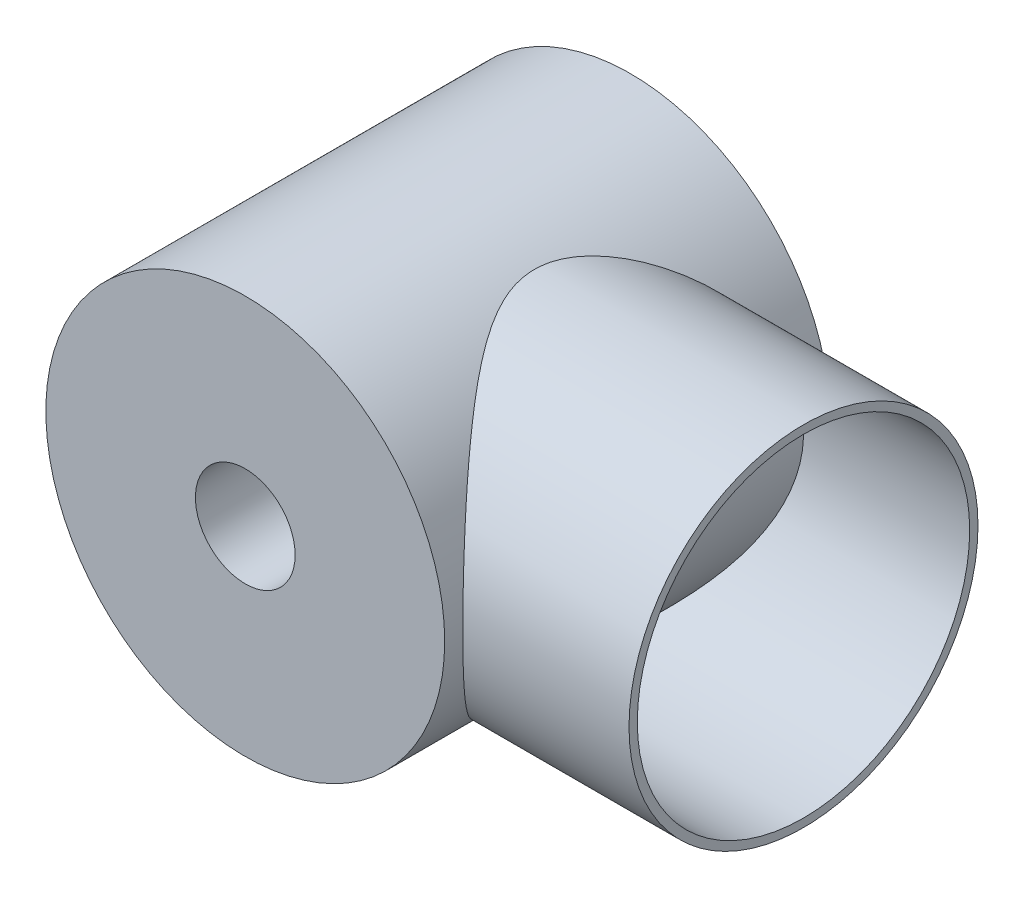
ISO-10303-21;
HEADER;
FILE_DESCRIPTION(('STEP AP214'),'2;1');
FILE_NAME('part.step','',(''),(''),'','','');
FILE_SCHEMA(('AUTOMOTIVE_DESIGN { 1 0 10303 214 1 1 1 1 }'));
ENDSEC;
DATA;
#1=APPLICATION_CONTEXT('core data for automotive mechanical design processes');
#2=APPLICATION_PROTOCOL_DEFINITION('international standard','automotive_design',2000,#1);
#3=PRODUCT_CONTEXT('',#1,'mechanical');
#4=PRODUCT('Part','Part','',(#3));
#5=PRODUCT_RELATED_PRODUCT_CATEGORY('part','',(#4));
#6=PRODUCT_DEFINITION_FORMATION('','',#4);
#7=PRODUCT_DEFINITION_CONTEXT('part definition',#1,'design');
#8=PRODUCT_DEFINITION('design','',#6,#7);
#9=PRODUCT_DEFINITION_SHAPE('','',#8);
#10=(LENGTH_UNIT() NAMED_UNIT(*) SI_UNIT(.MILLI.,.METRE.));
#11=(NAMED_UNIT(*) PLANE_ANGLE_UNIT() SI_UNIT($,.RADIAN.));
#12=(NAMED_UNIT(*) SI_UNIT($,.STERADIAN.) SOLID_ANGLE_UNIT());
#13=UNCERTAINTY_MEASURE_WITH_UNIT(LENGTH_MEASURE(1.E-05),#10,'distance_accuracy_value','');
#14=(GEOMETRIC_REPRESENTATION_CONTEXT(3) GLOBAL_UNCERTAINTY_ASSIGNED_CONTEXT((#13)) GLOBAL_UNIT_ASSIGNED_CONTEXT((#10,
#11,#12)) REPRESENTATION_CONTEXT('',''));
#15=CARTESIAN_POINT('',(0.,0.,0.));
#16=DIRECTION('',(0.,0.,1.));
#17=DIRECTION('',(1.,0.,0.));
#18=AXIS2_PLACEMENT_3D('',#15,#16,#17);
#19=CARTESIAN_POINT('',(0.,0.,11.59));
#20=DIRECTION('',(0.,0.,-1.));
#21=DIRECTION('',(-1.,0.,0.));
#22=AXIS2_PLACEMENT_3D('',#19,#20,#21);
#23=CYLINDRICAL_SURFACE('',#22,12.);
#24=CARTESIAN_POINT('',(0.,0.,-11.59));
#25=DIRECTION('',(0.,0.,1.));
#26=DIRECTION('',(1.,0.,0.));
#27=AXIS2_PLACEMENT_3D('',#24,#25,#26);
#28=CIRCLE('',#27,12.);
#29=CARTESIAN_POINT('',(12.,0.,-11.59));
#30=VERTEX_POINT('',#29);
#31=EDGE_CURVE('E56',#30,#30,#28,.T.);
#32=ORIENTED_EDGE('',*,*,#31,.T.);
#33=EDGE_LOOP('',(#32));
#34=FACE_BOUND('',#33,.T.);
#35=CARTESIAN_POINT('',(0.,0.,11.59));
#36=DIRECTION('',(0.,0.,1.));
#37=DIRECTION('',(1.,0.,0.));
#38=AXIS2_PLACEMENT_3D('',#35,#36,#37);
#39=CIRCLE('',#38,12.);
#40=CARTESIAN_POINT('',(12.,0.,11.59));
#41=VERTEX_POINT('',#40);
#42=EDGE_CURVE('E52',#41,#41,#39,.T.);
#43=ORIENTED_EDGE('',*,*,#42,.F.);
#44=EDGE_LOOP('',(#43));
#45=FACE_BOUND('',#44,.T.);
#46=CARTESIAN_POINT('',(12.,0.,10.5));
#47=CARTESIAN_POINT('',(12.0000025903653,-0.24558604890603,10.5000026221802));
#48=CARTESIAN_POINT('',(11.9924478021627,-0.491143091110179,10.4913713144256));
#49=CARTESIAN_POINT('',(11.9624069588974,-0.980228164058841,10.4570192353168));
#50=CARTESIAN_POINT('',(11.9399159340812,-1.22375549213633,10.4312927758688));
#51=CARTESIAN_POINT('',(11.8804709214165,-1.70697311727127,10.3631975988323));
#52=CARTESIAN_POINT('',(11.8434991208042,-1.94665830868732,10.3208083841995));
#53=CARTESIAN_POINT('',(11.7558971205219,-2.4200907159731,10.2201629403304));
#54=CARTESIAN_POINT('',(11.7052677347163,-2.65383828476176,10.1619076565615));
#55=CARTESIAN_POINT('',(11.5917363263428,-3.11240867885385,10.0309227115202));
#56=CARTESIAN_POINT('',(11.5289168775914,-3.3372799400861,9.9582903754688));
#57=CARTESIAN_POINT('',(11.3919253538222,-3.77854688486329,9.79936658575418));
#58=CARTESIAN_POINT('',(11.3177533564385,-3.9949426263552,9.71307522549779));
#59=CARTESIAN_POINT('',(11.1592499246099,-4.41839936925901,9.52791426218264));
#60=CARTESIAN_POINT('',(11.0749187093456,-4.62546057192703,9.42904493048543));
#61=CARTESIAN_POINT('',(10.8972933267443,-5.02968822295294,9.21976473013059));
#62=CARTESIAN_POINT('',(10.8039971837669,-5.22685247563546,9.10935131697894));
#63=CARTESIAN_POINT('',(10.5719821978322,-5.6852708343767,8.83314285254566));
#64=CARTESIAN_POINT('',(10.429664489806,-5.94177599474969,8.66245930514213));
#65=CARTESIAN_POINT('',(10.133124245459,-6.43448028365163,8.30304335697487));
#66=CARTESIAN_POINT('',(9.97889743454364,-6.67067205609087,8.114304469656));
#67=CARTESIAN_POINT('',(9.66113498425555,-7.12313550165952,7.72017921496088));
#68=CARTESIAN_POINT('',(9.49757858953896,-7.33935971584907,7.514755261539));
#69=CARTESIAN_POINT('',(9.16441058086817,-7.75137122108378,7.08900589052844));
#70=CARTESIAN_POINT('',(8.99479977841498,-7.94716123732065,6.86868246647187));
#71=CARTESIAN_POINT('',(8.64879235704844,-8.32255558506208,6.40898131755769));
#72=CARTESIAN_POINT('',(8.47232829590395,-8.50171905878693,6.16929485291087));
#73=CARTESIAN_POINT('',(8.11966742655011,-8.8391482189548,5.67529556124626));
#74=CARTESIAN_POINT('',(7.94347071966802,-8.99740732520555,5.42097816475408));
#75=CARTESIAN_POINT('',(7.59608439381062,-9.2925414758917,4.89782860138071));
#76=CARTESIAN_POINT('',(7.42488566142858,-9.42945771157486,4.62902577562138));
#77=CARTESIAN_POINT('',(7.09292709563488,-9.68161533422938,4.07539189749363));
#78=CARTESIAN_POINT('',(6.93215938653936,-9.79687320148583,3.79057324806286));
#79=CARTESIAN_POINT('',(6.70272548092893,-9.9540181446579,3.34562039931798));
#80=CARTESIAN_POINT('',(6.62720384630774,-10.0043802012314,3.19200408639717));
#81=CARTESIAN_POINT('',(6.4826178563582,-10.0986686951725,2.87985107426528));
#82=CARTESIAN_POINT('',(6.41355454358757,-10.1425940941262,2.72131358611881));
#83=CARTESIAN_POINT('',(6.21886576213597,-10.2639663436086,2.23846389426173));
#84=CARTESIAN_POINT('',(6.10534381158816,-10.3312741600506,1.90617758140119));
#85=CARTESIAN_POINT('',(5.97910379212586,-10.4044330112742,1.42095888555036));
#86=CARTESIAN_POINT('',(5.94600935426553,-10.4233397930653,1.27511781762611));
#87=CARTESIAN_POINT('',(5.88993273692875,-10.4551293758941,0.980879788119667));
#88=CARTESIAN_POINT('',(5.86694555544931,-10.4680151568769,0.832484128656912));
#89=CARTESIAN_POINT('',(5.83210012853904,-10.4874693297203,0.53414309161786));
#90=CARTESIAN_POINT('',(5.82022910044781,-10.4940449779299,0.384199694995097));
#91=CARTESIAN_POINT('',(5.8081380942995,-10.5007419087948,0.0836930075393301));
#92=CARTESIAN_POINT('',(5.80791807030667,-10.5008632168972,-0.0668702808473213));
#93=CARTESIAN_POINT('',(5.81914569299978,-10.494645546741,-0.367424269134964));
#94=CARTESIAN_POINT('',(5.83059321275956,-10.4883066387602,-0.517414975247014));
#95=CARTESIAN_POINT('',(5.86458429054789,-10.4693369115756,-0.815692979646308));
#96=CARTESIAN_POINT('',(5.88712816012854,-10.4567059157088,-0.963980229986008));
#97=CARTESIAN_POINT('',(5.97008010070904,-10.4097190017195,-1.40542735605979));
#98=CARTESIAN_POINT('',(6.04579285128222,-10.3662768288553,-1.6948453992242));
#99=CARTESIAN_POINT('',(6.20952100661563,-10.2688333186552,-2.20327366677666));
#100=CARTESIAN_POINT('',(6.29213418624526,-10.2186245270874,-2.42488032502771));
#101=CARTESIAN_POINT('',(6.47185087587738,-10.1057619428645,-2.8589927389968));
#102=CARTESIAN_POINT('',(6.56896412076779,-10.043099779979,-3.07149225615653));
#103=CARTESIAN_POINT('',(6.77384969572889,-9.90606861359904,-3.48828527476113));
#104=CARTESIAN_POINT('',(6.88165809116683,-9.83165946225597,-3.69254750233406));
#105=CARTESIAN_POINT('',(7.10439026367481,-9.67194152366887,-4.09266595591329));
#106=CARTESIAN_POINT('',(7.21931328746839,-9.58663388931121,-4.28852306812386));
#107=CARTESIAN_POINT('',(7.52500425628917,-9.35044870582154,-4.78912168735076));
#108=CARTESIAN_POINT('',(7.71943066182118,-9.19122329761677,-5.08771953413508));
#109=CARTESIAN_POINT('',(8.11251414051093,-8.84622452537325,-5.66637159369246));
#110=CARTESIAN_POINT('',(8.31117353069899,-8.66043628639261,-5.94641528685178));
#111=CARTESIAN_POINT('',(8.7068090725217,-8.26257373400461,-6.48788131649623));
#112=CARTESIAN_POINT('',(8.90378672233355,-8.05052617483594,-6.7493221855661));
#113=CARTESIAN_POINT('',(9.2914603406365,-7.59980878430902,-7.25307102876488));
#114=CARTESIAN_POINT('',(9.48215908761127,-7.3611509390847,-7.49538753379784));
#115=CARTESIAN_POINT('',(9.81082841557146,-6.91420075533417,-7.90657339363127));
#116=CARTESIAN_POINT('',(9.95093943001406,-6.71131864742179,-8.07962639160075));
#117=CARTESIAN_POINT('',(10.2227868486049,-6.28948009904293,-8.41216647525399));
#118=CARTESIAN_POINT('',(10.3545250490885,-6.07052712835023,-8.57165647329429));
#119=CARTESIAN_POINT('',(10.607383371961,-5.61700449517019,-8.87545230394878));
#120=CARTESIAN_POINT('',(10.728517153319,-5.38245562746785,-9.01977771870541));
#121=CARTESIAN_POINT('',(10.9581663729833,-4.89799950095816,-9.29175532390725));
#122=CARTESIAN_POINT('',(11.0666844007698,-4.64809541008193,-9.41941093662258));
#123=CARTESIAN_POINT('',(11.2497758816283,-4.18243751392102,-9.63379187929715));
#124=CARTESIAN_POINT('',(11.326890198614,-3.96914149680813,-9.72369481748747));
#125=CARTESIAN_POINT('',(11.4701456382366,-3.53386837020451,-9.89019931259147));
#126=CARTESIAN_POINT('',(11.5362891530332,-3.31189316627061,-9.96680376938061));
#127=CARTESIAN_POINT('',(11.6564525803127,-2.86036176242692,-10.105646732014));
#128=CARTESIAN_POINT('',(11.7104765265933,-2.63080811414519,-10.167890017933));
#129=CARTESIAN_POINT('',(11.8053976700532,-2.16540505537407,-10.2770687551359));
#130=CARTESIAN_POINT('',(11.8462947215005,-1.92955557502117,-10.3240040364736));
#131=CARTESIAN_POINT('',(11.9142946430721,-1.45192260174898,-10.4019605241754));
#132=CARTESIAN_POINT('',(11.9413214773392,-1.21011385829412,-10.4328940167348));
#133=CARTESIAN_POINT('',(11.980640047107,-0.723731229334801,-10.4778745769127));
#134=CARTESIAN_POINT('',(11.9929317495436,-0.479157337626871,-10.4919216066396));
#135=CARTESIAN_POINT('',(12.0024944206921,0.0106246137685572,-10.5028510068072));
#136=CARTESIAN_POINT('',(11.9997680486865,0.255832553498181,-10.4997364160926));
#137=CARTESIAN_POINT('',(11.9793633612438,0.744795662194218,-10.4764105888905));
#138=CARTESIAN_POINT('',(11.9616858638003,0.988550909904384,-10.4562002877291));
#139=CARTESIAN_POINT('',(11.913956439028,1.45156089085496,-10.4015631895457));
#140=CARTESIAN_POINT('',(11.8851109788372,1.6711067034065,-10.3685217126003));
#141=CARTESIAN_POINT('',(11.8158119612964,2.10596250308962,-10.2890131890822));
#142=CARTESIAN_POINT('',(11.775354498254,2.32127103893432,-10.2425416252692));
#143=CARTESIAN_POINT('',(11.6835395489358,2.74630136659227,-10.1368526227338));
#144=CARTESIAN_POINT('',(11.6321841272402,2.95602420813771,-10.0776375981858));
#145=CARTESIAN_POINT('',(11.519366076367,3.36898355356687,-9.94720389505369));
#146=CARTESIAN_POINT('',(11.4578996550021,3.57221758950684,-9.87598071249145));
#147=CARTESIAN_POINT('',(11.3213735850998,3.9845610198033,-9.71726548617345));
#148=CARTESIAN_POINT('',(11.2456829716614,4.19316690132703,-9.62900799066566));
#149=CARTESIAN_POINT('',(11.0849440062644,4.60132562657339,-9.44078228657388));
#150=CARTESIAN_POINT('',(10.9998919925847,4.80087488437629,-9.34080949454387));
#151=CARTESIAN_POINT('',(10.7324280919286,5.38498747416343,-9.02483706795108));
#152=CARTESIAN_POINT('',(10.5375977913022,5.75534109825832,-8.79265585040462));
#153=CARTESIAN_POINT('',(10.1740948391365,6.37047154757276,-8.35305487865372));
#154=CARTESIAN_POINT('',(10.0105258452599,6.62392982075989,-8.15327086839331));
#155=CARTESIAN_POINT('',(9.67297639946549,7.10777580196483,-7.73509785357259));
#156=CARTESIAN_POINT('',(9.49899123831573,7.33815294704928,-7.5167004145419));
#157=CARTESIAN_POINT('',(9.14332431546744,7.77687510489923,-7.06191166044643));
#158=CARTESIAN_POINT('',(8.96160858771937,7.98510488042494,-6.82543627984348));
#159=CARTESIAN_POINT('',(8.59500144733394,8.37843520427572,-6.33642361540248));
#160=CARTESIAN_POINT('',(8.41011081910704,8.56354137473876,-6.08389025842762));
#161=CARTESIAN_POINT('',(8.03698706814054,8.91481676904409,-5.55685934025764));
#162=CARTESIAN_POINT('',(7.84877528539779,9.08045034554202,-5.28198937416163));
#163=CARTESIAN_POINT('',(7.47867572399837,9.38760979824832,-4.71454775676812));
#164=CARTESIAN_POINT('',(7.29679350672787,9.52911487972747,-4.42196112797605));
#165=CARTESIAN_POINT('',(6.94837867167779,9.78603649231476,-3.81969711136786));
#166=CARTESIAN_POINT('',(6.78175177708081,9.90162071379585,-3.5101467142129));
#167=CARTESIAN_POINT('',(6.47384114023886,10.1056094013669,-2.87035050016313));
#168=CARTESIAN_POINT('',(6.33250267375604,10.1940728604937,-2.54015151048706));
#169=CARTESIAN_POINT('',(6.15985346225237,10.2985423492837,-2.05245847850691));
#170=CARTESIAN_POINT('',(6.11168753177131,10.3271407989073,-1.90356372424686));
#171=CARTESIAN_POINT('',(6.0245895260549,10.3781913452131,-1.60203477036296));
#172=CARTESIAN_POINT('',(5.98565642869412,10.4006441222976,-1.44940098673628));
#173=CARTESIAN_POINT('',(5.91863149455871,10.4389319046557,-1.14136554802649));
#174=CARTESIAN_POINT('',(5.89051059465489,10.4547846603991,-0.985972504431687));
#175=CARTESIAN_POINT('',(5.84627001468152,10.4795885327403,-0.672948535421863));
#176=CARTESIAN_POINT('',(5.83014780080854,10.4885411064873,-0.515318089655733));
#177=CARTESIAN_POINT('',(5.81067107452411,10.4993443513643,-0.197889583755956));
#178=CARTESIAN_POINT('',(5.80740793417247,10.5011441984928,-0.0380840792217009));
#179=CARTESIAN_POINT('',(5.81408445214377,10.4974489635292,0.281158586009935));
#180=CARTESIAN_POINT('',(5.82402395389477,10.4919539679477,0.440595751053041));
#181=CARTESIAN_POINT('',(5.85658684584122,10.4738117305548,0.758015431643872));
#182=CARTESIAN_POINT('',(5.87923193961312,10.4611522501141,0.915994986700402));
#183=CARTESIAN_POINT('',(5.93609191481797,10.4289918912942,1.2292037871392));
#184=CARTESIAN_POINT('',(5.97031348116929,10.4094870597727,1.38443138875641));
#185=CARTESIAN_POINT('',(6.06188363886104,10.3565057029025,1.74225850700297));
#186=CARTESIAN_POINT('',(6.12313826810396,10.3205407158027,1.94348872754572));
#187=CARTESIAN_POINT('',(6.25986367162051,10.2381864564169,2.33888644697971));
#188=CARTESIAN_POINT('',(6.33534391417927,10.1917902373195,2.5330491385767));
#189=CARTESIAN_POINT('',(6.49734753154075,10.0892854314696,2.91469994297496));
#190=CARTESIAN_POINT('',(6.58390186317658,10.0331494549734,3.10216738500362));
#191=CARTESIAN_POINT('',(6.76504918546079,9.91191273887809,3.47008444313837));
#192=CARTESIAN_POINT('',(6.85964094353364,9.84681337290843,3.65053512913104));
#193=CARTESIAN_POINT('',(7.12557922133376,9.65757254093554,4.13395137046132));
#194=CARTESIAN_POINT('',(7.30266744382479,9.52495218554386,4.43046339069947));
#195=CARTESIAN_POINT('',(7.66548848842536,9.23549312397922,5.0059390896183));
#196=CARTESIAN_POINT('',(7.85122682444907,9.07863881836812,5.28489130107697));
#197=CARTESIAN_POINT('',(8.22557652263309,8.74091208238489,5.82652651004595));
#198=CARTESIAN_POINT('',(8.41419147306511,8.56000703321834,6.08918668912839));
#199=CARTESIAN_POINT('',(8.78932707210988,8.17435730065542,6.59785592762631));
#200=CARTESIAN_POINT('',(8.97584822200196,7.96961846281605,6.8438690466485));
#201=CARTESIAN_POINT('',(9.34942506692481,7.5282672820182,7.32707545660313));
#202=CARTESIAN_POINT('',(9.53626200336328,7.29077782719624,7.56364008554897));
#203=CARTESIAN_POINT('',(9.89934590181626,6.78960375053121,8.01656705726689));
#204=CARTESIAN_POINT('',(10.0755903163608,6.52591286745919,8.23292454715827));
#205=CARTESIAN_POINT('',(10.4126946295768,5.97329434108303,8.6421997565215));
#206=CARTESIAN_POINT('',(10.5735999167197,5.68444632029707,8.83518711727031));
#207=CARTESIAN_POINT('',(10.8761523602539,5.08161737570254,9.19511717186231));
#208=CARTESIAN_POINT('',(11.0178135320434,4.76765501021565,9.36207883330993));
#209=CARTESIAN_POINT('',(11.23009155076,4.23495111743271,9.61080003857925));
#210=CARTESIAN_POINT('',(11.3078022340879,4.02313449132891,9.70145507200512));
#211=CARTESIAN_POINT('',(11.4524233478712,3.59080873686891,9.86964271373897));
#212=CARTESIAN_POINT('',(11.5193369351548,3.37030217280113,9.94717915795048));
#213=CARTESIAN_POINT('',(11.6411362909991,2.92195339374703,10.0879779431098));
#214=CARTESIAN_POINT('',(11.6960419691181,2.694124050913,10.1512639171048));
#215=CARTESIAN_POINT('',(11.7929250373672,2.23217567281641,10.2627403699584));
#216=CARTESIAN_POINT('',(11.8349061596291,1.99805847452374,10.3109352066461));
#217=CARTESIAN_POINT('',(11.9128454627825,1.4728271222533,10.4003112335192));
#218=CARTESIAN_POINT('',(11.9454329779767,1.18053075601639,10.4376009709755));
#219=CARTESIAN_POINT('',(11.9890114136456,0.5921428356668,10.4874468984026));
#220=CARTESIAN_POINT('',(11.999996877353,0.296050341643407,10.4999968390007));
#221=CARTESIAN_POINT('',(12.,0.,10.5));
#222=B_SPLINE_CURVE_WITH_KNOTS('',3,(#46,#47,#48,#49,#50,#51,#52,#53,#54,#55,#56,#57,#58,#59,
#60,#61,#62,#63,#64,#65,#66,#67,#68,#69,#70,#71,#72,#73,#74,#75,#76,#77,#78,#79,#80,#81,#82,#83,
#84,#85,#86,#87,#88,#89,#90,#91,#92,#93,#94,#95,#96,#97,#98,#99,#100,#101,#102,#103,#104,#105,
#106,#107,#108,#109,#110,#111,#112,#113,#114,#115,#116,#117,#118,#119,#120,#121,#122,#123,#124,
#125,#126,#127,#128,#129,#130,#131,#132,#133,#134,#135,#136,#137,#138,#139,#140,#141,#142,#143,
#144,#145,#146,#147,#148,#149,#150,#151,#152,#153,#154,#155,#156,#157,#158,#159,#160,#161,#162,
#163,#164,#165,#166,#167,#168,#169,#170,#171,#172,#173,#174,#175,#176,#177,#178,#179,#180,#181,
#182,#183,#184,#185,#186,#187,#188,#189,#190,#191,#192,#193,#194,#195,#196,#197,#198,#199,#200,
#201,#202,#203,#204,#205,#206,#207,#208,#209,#210,#211,#212,#213,#214,#215,#216,#217,#218,#219,
#220,#221),.UNSPECIFIED.,.T.,.F.,(4,2,2,2,2,2,2,2,2,2,2,2,2,2,2,2,2,2,2,2,2,2,2,2,2,2,2,2,2,2,2,
2,2,2,2,2,2,2,2,2,2,2,2,2,2,2,2,2,2,2,2,2,2,2,2,2,2,2,2,2,2,2,2,2,2,2,2,2,2,2,2,2,2,2,2,2,2,2,2,
2,2,2,2,2,2,2,2,4),(0.,0.736443215987455,1.47313159254039,2.21072902801261,2.94828251927975,
3.68100412756586,4.41372072537321,5.14642151797686,5.87928415099485,6.89595184836924,
7.9129861750021,8.93237871612938,9.95163513253349,10.9929033183364,12.0344984931894,
13.0740578371758,14.1128229278881,14.6478323312282,15.1829279518214,16.2504996652621,
16.7023400328165,17.1539565356893,17.6050530767581,18.0561478393145,18.5072376946588,
18.958340215971,19.8615162043157,20.5859048530417,21.3107820386846,22.0381925324744,
22.7655261414074,23.9347635890391,25.1046583822875,26.2733708893332,27.4415590810118,
28.3444876724492,29.2472218876319,30.1487756859305,31.0501441054473,31.781372783449,
32.5124418084136,33.243267146967,33.9741005987096,34.7088987602165,35.4436985705335,
36.1783682724645,36.9129977823593,37.5839004547656,38.2550290499821,38.9260306155491,
39.5972844202413,40.3130326444617,41.0290618359967,42.4600300823101,43.5442053941916,
44.628874627181,45.7189367630977,46.8087333497111,47.9236816118145,49.0395859687851,
50.1480483896437,51.2540822918226,51.7309853231305,52.2078355339763,52.6833948604945,
53.1588537330112,53.6376850219322,54.1165106323784,54.5961566695063,55.0760801558834,
55.715225849865,56.354798458511,56.9961996947207,57.6375027460756,58.7457127583895,
59.8546391226946,60.9650851092936,62.0752593156364,63.2250773796133,64.3751708739033,
65.5217481260786,66.6674858026246,67.3962907425804,68.124882208735,68.852256327421,
69.5794202100377,70.4669674213411,71.3547388019437),.UNSPECIFIED.);
#223=CARTESIAN_POINT('',(12.,0.,10.5));
#224=VERTEX_POINT('',#223);
#225=EDGE_CURVE('E11',#224,#224,#222,.T.);
#226=ORIENTED_EDGE('',*,*,#225,.F.);
#227=EDGE_LOOP('',(#226));
#228=FACE_BOUND('',#227,.T.);
#229=ADVANCED_FACE('F40',(#34,#45,#228),#23,.T.);
#230=CARTESIAN_POINT('',(0.,0.,11.59));
#231=DIRECTION('',(0.,0.,1.));
#232=DIRECTION('',(1.,0.,0.));
#233=AXIS2_PLACEMENT_3D('',#230,#231,#232);
#234=PLANE('',#233);
#235=CARTESIAN_POINT('',(0.,0.,11.59));
#236=DIRECTION('',(0.,0.,1.));
#237=DIRECTION('',(1.,0.,0.));
#238=AXIS2_PLACEMENT_3D('',#235,#236,#237);
#239=CIRCLE('',#238,3.);
#240=CARTESIAN_POINT('',(3.,0.,11.59));
#241=VERTEX_POINT('',#240);
#242=EDGE_CURVE('E126',#241,#241,#239,.T.);
#243=ORIENTED_EDGE('',*,*,#242,.F.);
#244=EDGE_LOOP('',(#243));
#245=FACE_BOUND('',#244,.T.);
#246=ORIENTED_EDGE('',*,*,#42,.T.);
#247=EDGE_LOOP('',(#246));
#248=FACE_BOUND('',#247,.T.);
#249=ADVANCED_FACE('F88',(#245,#248),#234,.T.);
#250=CARTESIAN_POINT('',(0.,0.,-11.59));
#251=DIRECTION('',(0.,0.,1.));
#252=DIRECTION('',(1.,0.,0.));
#253=AXIS2_PLACEMENT_3D('',#250,#251,#252);
#254=PLANE('',#253);
#255=CARTESIAN_POINT('',(0.,0.,-11.59));
#256=DIRECTION('',(0.,0.,1.));
#257=DIRECTION('',(1.,0.,0.));
#258=AXIS2_PLACEMENT_3D('',#255,#256,#257);
#259=CIRCLE('',#258,7.5);
#260=CARTESIAN_POINT('',(7.5,0.,-11.59));
#261=VERTEX_POINT('',#260);
#262=EDGE_CURVE('E130',#261,#261,#259,.T.);
#263=ORIENTED_EDGE('',*,*,#262,.T.);
#264=EDGE_LOOP('',(#263));
#265=FACE_BOUND('',#264,.T.);
#266=ORIENTED_EDGE('',*,*,#31,.F.);
#267=EDGE_LOOP('',(#266));
#268=FACE_BOUND('',#267,.T.);
#269=ADVANCED_FACE('F86',(#265,#268),#254,.F.);
#270=CARTESIAN_POINT('',(22.,0.,0.));
#271=DIRECTION('',(-1.,0.,0.));
#272=DIRECTION('',(0.,0.,1.));
#273=AXIS2_PLACEMENT_3D('',#270,#271,#272);
#274=CYLINDRICAL_SURFACE('',#273,10.5);
#275=CARTESIAN_POINT('',(22.,0.,0.));
#276=DIRECTION('',(1.,0.,0.));
#277=DIRECTION('',(0.,0.,-1.));
#278=AXIS2_PLACEMENT_3D('',#275,#276,#277);
#279=CIRCLE('',#278,10.5);
#280=CARTESIAN_POINT('',(22.,0.,-10.5));
#281=VERTEX_POINT('',#280);
#282=EDGE_CURVE('E64',#281,#281,#279,.T.);
#283=ORIENTED_EDGE('',*,*,#282,.F.);
#284=EDGE_LOOP('',(#283));
#285=FACE_BOUND('',#284,.T.);
#286=ORIENTED_EDGE('',*,*,#225,.T.);
#287=EDGE_LOOP('',(#286));
#288=FACE_BOUND('',#287,.T.);
#289=ADVANCED_FACE('F77',(#285,#288),#274,.T.);
#290=CARTESIAN_POINT('',(22.,0.,0.));
#291=DIRECTION('',(-1.,0.,0.));
#292=DIRECTION('',(0.,0.,1.));
#293=AXIS2_PLACEMENT_3D('',#290,#291,#292);
#294=CYLINDRICAL_SURFACE('',#293,10.);
#295=CARTESIAN_POINT('',(22.,0.,0.));
#296=DIRECTION('',(1.,0.,0.));
#297=DIRECTION('',(0.,0.,-1.));
#298=AXIS2_PLACEMENT_3D('',#295,#296,#297);
#299=CIRCLE('',#298,10.);
#300=CARTESIAN_POINT('',(22.,0.,-10.));
#301=VERTEX_POINT('',#300);
#302=EDGE_CURVE('E137',#301,#301,#299,.T.);
#303=ORIENTED_EDGE('',*,*,#302,.T.);
#304=EDGE_LOOP('',(#303));
#305=FACE_BOUND('',#304,.T.);
#306=CARTESIAN_POINT('',(12.,0.,10.));
#307=CARTESIAN_POINT('',(11.9999986946263,-0.23753862681051,9.9999986592266));
#308=CARTESIAN_POINT('',(11.9929317637127,-0.475097310834713,9.9915214654337));
#309=CARTESIAN_POINT('',(11.9648277258961,-0.948194733217877,9.95777024534031));
#310=CARTESIAN_POINT('',(11.9437890172112,-1.18373323683865,9.93249429316123));
#311=CARTESIAN_POINT('',(11.8882130159279,-1.65099412276372,9.86559452562533));
#312=CARTESIAN_POINT('',(11.853667736289,-1.88271416238804,9.82396103725329));
#313=CARTESIAN_POINT('',(11.771840611643,-2.34047838612048,9.72507077248591));
#314=CARTESIAN_POINT('',(11.7245588468193,-2.56652260595131,9.66781409444737));
#315=CARTESIAN_POINT('',(11.6185501275112,-3.01014891283527,9.53897472212715));
#316=CARTESIAN_POINT('',(11.5598942948915,-3.22777399242385,9.46748098074202));
#317=CARTESIAN_POINT('',(11.4320437420636,-3.65486978047283,9.31094319955617));
#318=CARTESIAN_POINT('',(11.3628492252024,-3.86434064617326,9.22589942120588));
#319=CARTESIAN_POINT('',(11.2150690200861,-4.2743083640831,9.04326564702361));
#320=CARTESIAN_POINT('',(11.1364824889733,-4.47480440865187,8.94567452510885));
#321=CARTESIAN_POINT('',(10.9710957625123,-4.86623321377271,8.7389237497878));
#322=CARTESIAN_POINT('',(10.8842938230227,-5.05716393037646,8.62976163925357));
#323=CARTESIAN_POINT('',(10.6704602419154,-5.49737670675755,8.35870807319768));
#324=CARTESIAN_POINT('',(10.5403636258876,-5.74232938257672,8.19217728727312));
#325=CARTESIAN_POINT('',(10.2699529861572,-6.21303437342286,7.84120281489898));
#326=CARTESIAN_POINT('',(10.1296355083185,-6.43878014107997,7.65675306564965));
#327=CARTESIAN_POINT('',(9.84134049986647,-6.8713707837968,7.27106937786591));
#328=CARTESIAN_POINT('',(9.69334457418352,-7.07816664457374,7.06979435370438));
#329=CARTESIAN_POINT('',(9.39298576076389,-7.47215961815005,6.6520133131359));
#330=CARTESIAN_POINT('',(9.24062342489106,-7.6593591939,6.43550921652093));
#331=CARTESIAN_POINT('',(8.9318189592574,-8.01745028948662,5.9837368345203));
#332=CARTESIAN_POINT('',(8.77535334287153,-8.18797839637913,5.7481966033151));
#333=CARTESIAN_POINT('',(8.4648183272293,-8.50862247952956,5.26195867373952));
#334=CARTESIAN_POINT('',(8.31074974558348,-8.65873162059535,5.01125594013474));
#335=CARTESIAN_POINT('',(8.01002279123855,-8.93764255759842,4.4949323790475));
#336=CARTESIAN_POINT('',(7.86334754810993,-9.06649454433457,4.22934873467283));
#337=CARTESIAN_POINT('',(7.58310934132184,-9.3021463855141,3.68222698180521));
#338=CARTESIAN_POINT('',(7.44953525664938,-9.40896502959641,3.40070273051951));
#339=CARTESIAN_POINT('',(7.1916673887072,-9.60774853072455,2.79327682372877));
#340=CARTESIAN_POINT('',(7.06941545633824,-9.69738421312204,2.46568859065407));
#341=CARTESIAN_POINT('',(6.91505658217369,-9.80744741834452,1.96051980079937));
#342=CARTESIAN_POINT('',(6.8684614865934,-9.84005650619368,1.78995044207254));
#343=CARTESIAN_POINT('',(6.78668896237614,-9.89663182401674,1.44472632548071));
#344=CARTESIAN_POINT('',(6.75150551723288,-9.9206026090618,1.27007377262171));
#345=CARTESIAN_POINT('',(6.69379435674695,-9.95963662205412,0.915353649375761));
#346=CARTESIAN_POINT('',(6.67143428859055,-9.97458198358349,0.735245389552158));
#347=CARTESIAN_POINT('',(6.64129618150677,-9.99467457494857,0.373263745331758));
#348=CARTESIAN_POINT('',(6.63351677907191,-9.99982272096926,0.191390527583609));
#349=CARTESIAN_POINT('',(6.63299599103252,-10.0001682520453,-0.172388440006929));
#350=CARTESIAN_POINT('',(6.64025463783519,-9.99536561565656,-0.35429418991858));
#351=CARTESIAN_POINT('',(6.66938049788003,-9.97595413578333,-0.716400626365283));
#352=CARTESIAN_POINT('',(6.69124949057611,-9.96134409781414,-0.896601102496471));
#353=CARTESIAN_POINT('',(6.75076632121966,-9.92111596165679,-1.26857859432482));
#354=CARTESIAN_POINT('',(6.78956909235216,-9.89468770806293,-1.4600811592211));
#355=CARTESIAN_POINT('',(6.88077615360517,-9.83147920003793,-1.83815157523852));
#356=CARTESIAN_POINT('',(6.93319006535955,-9.79469162110314,-2.02471583228132));
#357=CARTESIAN_POINT('',(7.04938668729169,-9.71139838500988,-2.39257439912018));
#358=CARTESIAN_POINT('',(7.11319975630691,-9.66486671842588,-2.57385309441864));
#359=CARTESIAN_POINT('',(7.24979770953338,-9.56282955048626,-2.93029953719349));
#360=CARTESIAN_POINT('',(7.32258076947732,-9.50732587309556,-3.10546851796295));
#361=CARTESIAN_POINT('',(7.52002620157219,-9.3526903966056,-3.55120790802892));
#362=CARTESIAN_POINT('',(7.64999681540141,-9.24711619063717,-3.81720421643706));
#363=CARTESIAN_POINT('',(7.92089573141097,-9.01616131834054,-4.33464800745454));
#364=CARTESIAN_POINT('',(8.06183043453655,-8.89076903728569,-4.58608683958992));
#365=CARTESIAN_POINT('',(8.34983243477317,-8.6208648661212,-5.07531461727038));
#366=CARTESIAN_POINT('',(8.49690777611457,-8.47632732096208,-5.31308462220479));
#367=CARTESIAN_POINT('',(8.79305561060683,-8.16870695642698,-5.77487433850598));
#368=CARTESIAN_POINT('',(8.94212769735792,-8.005627861717,-5.99889679763581));
#369=CARTESIAN_POINT('',(9.24684091668315,-7.65200807426175,-6.44452100499447));
#370=CARTESIAN_POINT('',(9.40241756240579,-7.46047687161961,-6.66538254568004));
#371=CARTESIAN_POINT('',(9.7089291047966,-7.05697567964306,-7.09120029379771));
#372=CARTESIAN_POINT('',(9.85986330836621,-6.84500265777255,-7.29615413316359));
#373=CARTESIAN_POINT('',(10.1536570090839,-6.40109128405044,-7.68853791168031));
#374=CARTESIAN_POINT('',(10.2965311623855,-6.16919124157131,-7.87600009183294));
#375=CARTESIAN_POINT('',(10.5713846138935,-5.68534760173844,-8.23206958935021));
#376=CARTESIAN_POINT('',(10.7033675880155,-5.43341082388998,-8.40068327519924));
#377=CARTESIAN_POINT('',(10.9227408177368,-4.97410770928851,-8.67822583550555));
#378=CARTESIAN_POINT('',(11.0131458591441,-4.77089748288007,-8.79166997956552));
#379=CARTESIAN_POINT('',(11.1845520319684,-4.35391530134588,-9.00545876818209));
#380=CARTESIAN_POINT('',(11.2655553824379,-4.14014585553111,-9.10580650454281));
#381=CARTESIAN_POINT('',(11.4167599775354,-3.70284910317574,-9.2922213813096));
#382=CARTESIAN_POINT('',(11.4869648450221,-3.47932510170966,-9.37829331196798));
#383=CARTESIAN_POINT('',(11.6152633382446,-3.023524501971,-9.53500748487181));
#384=CARTESIAN_POINT('',(11.673356767642,-2.79124776187984,-9.60564947698341));
#385=CARTESIAN_POINT('',(11.776595416883,-2.31754327580021,-9.73085117713554));
#386=CARTESIAN_POINT('',(11.8216366379026,-2.0760584961561,-9.78528180488847));
#387=CARTESIAN_POINT('',(11.8970998073304,-1.58748370255009,-9.87631677097475));
#388=CARTESIAN_POINT('',(11.9275217231202,-1.34039367608314,-9.91292106953425));
#389=CARTESIAN_POINT('',(11.9729653223642,-0.842888051642071,-9.96755379851639));
#390=CARTESIAN_POINT('',(11.9879951289117,-0.592474278513259,-9.98559202709666));
#391=CARTESIAN_POINT('',(12.0022833315825,-0.0905626108662608,-10.0027410852894));
#392=CARTESIAN_POINT('',(12.0015434437609,0.160935162713332,-10.0018539743537));
#393=CARTESIAN_POINT('',(11.9853569292215,0.632480092386548,-9.98242462720666));
#394=CARTESIAN_POINT('',(11.9716850040003,0.852681233105042,-9.9660128662083));
#395=CARTESIAN_POINT('',(11.9324360633225,1.29044638809044,-9.91883070876267));
#396=CARTESIAN_POINT('',(11.9068601907369,1.50801065346079,-9.88806169072227));
#397=CARTESIAN_POINT('',(11.8443032609981,1.93905109547449,-9.81264299991756));
#398=CARTESIAN_POINT('',(11.807321598809,2.15252705460976,-9.76799259079451));
#399=CARTESIAN_POINT('',(11.7226378861666,2.57410035149833,-9.66545778129649));
#400=CARTESIAN_POINT('',(11.6749353083904,2.78219742412215,-9.60757272995505));
#401=CARTESIAN_POINT('',(11.5689421064955,3.19460527438141,-9.47849123061689));
#402=CARTESIAN_POINT('',(11.5105211615229,3.39883093411672,-9.40713058493372));
#403=CARTESIAN_POINT('',(11.3844408859001,3.79982955656098,-9.25243230257396));
#404=CARTESIAN_POINT('',(11.3167779927466,3.99659960780287,-9.1690900466797));
#405=CARTESIAN_POINT('',(11.1732264127657,4.38192662577754,-8.99131463404353));
#406=CARTESIAN_POINT('',(11.0973381507974,4.57048401600856,-8.89688205012154));
#407=CARTESIAN_POINT('',(10.9383330466027,4.93894261695939,-8.69774227433451));
#408=CARTESIAN_POINT('',(10.8552147548795,5.11884208063237,-8.59303302163139));
#409=CARTESIAN_POINT('',(10.6439805210146,5.54850518056512,-8.32489626674853));
#410=CARTESIAN_POINT('',(10.5124291397805,5.79333350953019,-8.15622778831036));
#411=CARTESIAN_POINT('',(10.2392157259113,6.26358298714733,-7.80092623866425));
#412=CARTESIAN_POINT('',(10.0975498102484,6.48899660831181,-7.61428625840227));
#413=CARTESIAN_POINT('',(9.80666039893035,6.92079147379189,-7.22409587320212));
#414=CARTESIAN_POINT('',(9.65741662376414,7.12711697255386,-7.02049904517836));
#415=CARTESIAN_POINT('',(9.35476797433519,7.51995907746756,-6.59798703742048));
#416=CARTESIAN_POINT('',(9.2013636904013,7.70647847561028,-6.37907402398755));
#417=CARTESIAN_POINT('',(8.89081456967673,8.06289381917545,-5.92242687075387));
#418=CARTESIAN_POINT('',(8.73365192488638,8.23243250026889,-5.68442600212601));
#419=CARTESIAN_POINT('',(8.42212029518395,8.55087705302471,-5.19309763505775));
#420=CARTESIAN_POINT('',(8.26775233281293,8.69977550021477,-4.93976466835844));
#421=CARTESIAN_POINT('',(7.96704540895895,8.97595200325835,-4.4180480009755));
#422=CARTESIAN_POINT('',(7.82068599215416,9.10328706628637,-4.14970656138851));
#423=CARTESIAN_POINT('',(7.54190400496398,9.33555315323546,-3.59685211227954));
#424=CARTESIAN_POINT('',(7.40946872050071,9.44050470714313,-3.31235422730655));
#425=CARTESIAN_POINT('',(7.15701446157447,9.63350154896967,-2.70286274068464));
#426=CARTESIAN_POINT('',(7.03879769630346,9.71956147086536,-2.37644483936898));
#427=CARTESIAN_POINT('',(6.89089691104911,9.82441969074176,-1.87351856472906));
#428=CARTESIAN_POINT('',(6.84652139767443,9.85532071354149,-1.7037827363293));
#429=CARTESIAN_POINT('',(6.76925667022552,9.90855005194039,-1.36043207360685));
#430=CARTESIAN_POINT('',(6.73636146700503,9.93088283809629,-1.18681931228654));
#431=CARTESIAN_POINT('',(6.68325070011165,9.96670520089901,-0.834565006552853));
#432=CARTESIAN_POINT('',(6.66319322317324,9.98008461157072,-0.655888041930247));
#433=CARTESIAN_POINT('',(6.6374859254552,9.99720084607872,-0.297036795393576));
#434=CARTESIAN_POINT('',(6.63183489505733,10.0009384794744,-0.116862640463658));
#435=CARTESIAN_POINT('',(6.63526696721492,9.99866172092865,0.243321430544462));
#436=CARTESIAN_POINT('',(6.64435330730042,9.99264518617548,0.423331301839945));
#437=CARTESIAN_POINT('',(6.67674184761187,9.97103242898447,0.78148241092018));
#438=CARTESIAN_POINT('',(6.70004592597447,9.95543494091875,0.959623398665958));
#439=CARTESIAN_POINT('',(6.76279785355143,9.91292812331496,1.3313378555944));
#440=CARTESIAN_POINT('',(6.80369410111863,9.88499570415073,1.52454756084707));
#441=CARTESIAN_POINT('',(6.89912692495593,9.81862568765559,1.90580287475068));
#442=CARTESIAN_POINT('',(6.95367343223467,9.78018044000334,2.09384461250947));
#443=CARTESIAN_POINT('',(7.0740921798325,9.69343740330896,2.4644674001535));
#444=CARTESIAN_POINT('',(7.13999440961262,9.64511346086735,2.64703244822803));
#445=CARTESIAN_POINT('',(7.28067162511726,9.53936962127991,3.00589678121547));
#446=CARTESIAN_POINT('',(7.35544472956116,9.4819516518772,3.18219738438386));
#447=CARTESIAN_POINT('',(7.55803923264405,9.32207448516632,3.63105814208639));
#448=CARTESIAN_POINT('',(7.691095675731,9.21305071650745,3.89893027907601));
#449=CARTESIAN_POINT('',(7.96782440557708,8.97480847492169,4.41983033045054));
#450=CARTESIAN_POINT('',(8.11150283865696,8.8455782607263,4.67284949597257));
#451=CARTESIAN_POINT('',(8.40461304999925,8.5675752749846,5.16493907762272));
#452=CARTESIAN_POINT('',(8.55405230094174,8.41877647269124,5.40399029036897));
#453=CARTESIAN_POINT('',(8.85450320138019,8.10218582770209,5.86800175536221));
#454=CARTESIAN_POINT('',(9.0055145282402,7.93439781499526,6.09296483491782));
#455=CARTESIAN_POINT('',(9.31323827095855,7.57119559238983,6.53940481148953));
#456=CARTESIAN_POINT('',(9.46986610482866,7.37482889750668,6.76016694491277));
#457=CARTESIAN_POINT('',(9.77790797150032,6.96125121941953,7.1853271975674));
#458=CARTESIAN_POINT('',(9.92932118013302,6.7440369616262,7.3897227367697));
#459=CARTESIAN_POINT('',(10.2234152200868,6.28927481271346,7.78040529624686));
#460=CARTESIAN_POINT('',(10.3661121194149,6.05176639954502,7.96672603390551));
#461=CARTESIAN_POINT('',(10.639856085313,5.55639020805979,8.31979293814834));
#462=CARTESIAN_POINT('',(10.770907594962,5.29853026600229,8.4865465780403));
#463=CARTESIAN_POINT('',(10.9860963090302,4.83254020829013,8.75781002096765));
#464=CARTESIAN_POINT('',(11.0735949138855,4.62882092505636,8.86725688916179));
#465=CARTESIAN_POINT('',(11.2390610339694,4.21116688976031,9.07305011618152));
#466=CARTESIAN_POINT('',(11.317030741844,3.9972345035987,9.16939948938042));
#467=CARTESIAN_POINT('',(11.4620377373209,3.56014859307968,9.3477806626755));
#468=CARTESIAN_POINT('',(11.5290856679758,3.33700431462121,9.42982640691541));
#469=CARTESIAN_POINT('',(11.6510502485894,2.88242483109707,9.5785586141698));
#470=CARTESIAN_POINT('',(11.7059685831843,2.65099078256341,9.64524721013861));
#471=CARTESIAN_POINT('',(11.794284376922,2.22135699523321,9.75222485049683));
#472=CARTESIAN_POINT('',(11.8297545578426,2.02421705485504,9.79507623623704));
#473=CARTESIAN_POINT('',(11.8910080702715,1.62618296943787,9.86896657443577));
#474=CARTESIAN_POINT('',(11.9167890083409,1.42528790965654,9.90000260828812));
#475=CARTESIAN_POINT('',(11.9582175749458,1.02094606327857,9.94983213539062));
#476=CARTESIAN_POINT('',(11.9738653464297,0.817499312719861,9.96862580134368));
#477=CARTESIAN_POINT('',(11.9947554767589,0.409373065971112,9.99370833488194));
#478=CARTESIAN_POINT('',(12.0000011248787,0.204693980001155,10.0000011553836));
#479=CARTESIAN_POINT('',(12.,0.,10.));
#480=B_SPLINE_CURVE_WITH_KNOTS('',3,(#306,#307,#308,#309,#310,#311,#312,#313,#314,#315,#316,
#317,#318,#319,#320,#321,#322,#323,#324,#325,#326,#327,#328,#329,#330,#331,#332,#333,#334,#335,
#336,#337,#338,#339,#340,#341,#342,#343,#344,#345,#346,#347,#348,#349,#350,#351,#352,#353,#354,
#355,#356,#357,#358,#359,#360,#361,#362,#363,#364,#365,#366,#367,#368,#369,#370,#371,#372,#373,
#374,#375,#376,#377,#378,#379,#380,#381,#382,#383,#384,#385,#386,#387,#388,#389,#390,#391,#392,
#393,#394,#395,#396,#397,#398,#399,#400,#401,#402,#403,#404,#405,#406,#407,#408,#409,#410,#411,
#412,#413,#414,#415,#416,#417,#418,#419,#420,#421,#422,#423,#424,#425,#426,#427,#428,#429,#430,
#431,#432,#433,#434,#435,#436,#437,#438,#439,#440,#441,#442,#443,#444,#445,#446,#447,#448,#449,
#450,#451,#452,#453,#454,#455,#456,#457,#458,#459,#460,#461,#462,#463,#464,#465,#466,#467,#468,
#469,#470,#471,#472,#473,#474,#475,#476,#477,#478,#479),.UNSPECIFIED.,.T.,.F.,(4,2,2,2,2,2,2,2,
2,2,2,2,2,2,2,2,2,2,2,2,2,2,2,2,2,2,2,2,2,2,2,2,2,2,2,2,2,2,2,2,2,2,2,2,2,2,2,2,2,2,2,2,2,2,2,2,
2,2,2,2,2,2,2,2,2,2,2,2,2,2,2,2,2,2,2,2,2,2,2,2,2,2,2,2,2,2,4),(0.,0.712397062250121,
1.4248758107137,2.13777651856139,2.85067273840018,3.55924716650969,4.26780792420149,
4.97643231733645,5.68520749121884,6.65434611294056,7.62381378795323,8.5957221245809,
9.56750816029715,10.5571736525889,11.5471696216552,12.5347935532193,13.5215717426579,
14.6007980373592,15.1396950633942,15.6783075059077,16.2238097928958,16.7692610648216,
17.3147135122036,17.8602324045889,18.4508473675646,19.0418809746284,19.6345127811868,
20.227024259833,21.168502270697,22.1105341112167,23.053841311487,23.9969593518871,
24.9894330258728,25.982054160108,26.9728079544534,27.9632259769397,28.711578275044,
29.4597535810797,30.2076773264519,30.9556131954731,31.7093542603401,32.4630970069359,
33.2164417650027,33.969704544652,34.6326143315187,35.2954604870486,35.9583418102252,
36.621255745268,37.2928399182063,37.9646837018408,38.6364927997213,39.3084368955974,
40.2823505169183,41.2566400608232,42.2336906153963,43.2106032555004,44.2050001936026,
45.1997539018889,46.1918352695399,47.1830027567368,48.252317557963,48.7862317690552,
49.3198670253892,49.8599532057932,50.399994037081,50.9401535215054,51.4803843754422,
52.077831645663,52.6757148483662,53.2752019100566,53.8745620627166,54.8281385139969,
55.782271129001,56.7376860476955,57.6929086082532,58.6950792139269,59.697407491973,
60.6978285086428,61.6978661798417,62.4389733768376,63.1799097190461,63.9201196575145,
64.6602267261338,65.2741714228783,65.8882676768444,66.5023552675758,67.1162486455544),.UNSPECIFIED.);
#481=CARTESIAN_POINT('',(12.,0.,10.));
#482=VERTEX_POINT('',#481);
#483=EDGE_CURVE('E61',#482,#482,#480,.T.);
#484=ORIENTED_EDGE('',*,*,#483,.F.);
#485=EDGE_LOOP('',(#484));
#486=FACE_BOUND('',#485,.T.);
#487=ADVANCED_FACE('F71',(#305,#486),#294,.F.);
#488=CARTESIAN_POINT('',(22.,0.,0.));
#489=DIRECTION('',(1.,0.,0.));
#490=DIRECTION('',(0.,0.,-1.));
#491=AXIS2_PLACEMENT_3D('',#488,#489,#490);
#492=PLANE('',#491);
#493=ORIENTED_EDGE('',*,*,#282,.T.);
#494=EDGE_LOOP('',(#493));
#495=FACE_BOUND('',#494,.T.);
#496=ORIENTED_EDGE('',*,*,#302,.F.);
#497=EDGE_LOOP('',(#496));
#498=FACE_BOUND('',#497,.T.);
#499=ADVANCED_FACE('F76',(#495,#498),#492,.T.);
#500=ORIENTED_EDGE('',*,*,#483,.T.);
#501=EDGE_LOOP('',(#500));
#502=FACE_BOUND('',#501,.T.);
#503=ADVANCED_FACE('F42',(#502),#23,.T.);
#504=CARTESIAN_POINT('',(0.,0.,11.59));
#505=DIRECTION('',(0.,0.,-1.));
#506=DIRECTION('',(-1.,0.,0.));
#507=AXIS2_PLACEMENT_3D('',#504,#505,#506);
#508=CYLINDRICAL_SURFACE('',#507,7.5);
#509=ORIENTED_EDGE('',*,*,#262,.F.);
#510=EDGE_LOOP('',(#509));
#511=FACE_BOUND('',#510,.T.);
#512=CARTESIAN_POINT('',(0.,0.,7.09));
#513=DIRECTION('',(0.,0.,1.));
#514=DIRECTION('',(1.,0.,0.));
#515=AXIS2_PLACEMENT_3D('',#512,#513,#514);
#516=CIRCLE('',#515,7.5);
#517=CARTESIAN_POINT('',(7.5,0.,7.09));
#518=VERTEX_POINT('',#517);
#519=EDGE_CURVE('E132',#518,#518,#516,.T.);
#520=ORIENTED_EDGE('',*,*,#519,.T.);
#521=EDGE_LOOP('',(#520));
#522=FACE_BOUND('',#521,.T.);
#523=ADVANCED_FACE('F103',(#511,#522),#508,.F.);
#524=CARTESIAN_POINT('',(0.,0.,7.09));
#525=DIRECTION('',(0.,0.,1.));
#526=DIRECTION('',(1.,0.,0.));
#527=AXIS2_PLACEMENT_3D('',#524,#525,#526);
#528=PLANE('',#527);
#529=CARTESIAN_POINT('',(0.,0.,7.09));
#530=DIRECTION('',(0.,0.,1.));
#531=DIRECTION('',(1.,0.,0.));
#532=AXIS2_PLACEMENT_3D('',#529,#530,#531);
#533=CIRCLE('',#532,3.);
#534=CARTESIAN_POINT('',(3.,0.,7.09));
#535=VERTEX_POINT('',#534);
#536=EDGE_CURVE('E129',#535,#535,#533,.F.);
#537=ORIENTED_EDGE('',*,*,#536,.F.);
#538=EDGE_LOOP('',(#537));
#539=FACE_BOUND('',#538,.T.);
#540=ORIENTED_EDGE('',*,*,#519,.F.);
#541=EDGE_LOOP('',(#540));
#542=FACE_BOUND('',#541,.T.);
#543=ADVANCED_FACE('F79',(#539,#542),#528,.F.);
#544=CARTESIAN_POINT('',(0.,0.,-11.591));
#545=DIRECTION('',(0.,0.,1.));
#546=DIRECTION('',(1.,0.,0.));
#547=AXIS2_PLACEMENT_3D('',#544,#545,#546);
#548=CYLINDRICAL_SURFACE('',#547,3.);
#549=CARTESIAN_POINT('',(3.,0.,11.59));
#550=CARTESIAN_POINT('',(3.,0.,11.543125));
#551=CARTESIAN_POINT('',(3.,0.,11.49625));
#552=CARTESIAN_POINT('',(3.,0.,11.4025));
#553=CARTESIAN_POINT('',(3.,0.,11.355625));
#554=CARTESIAN_POINT('',(3.,0.,11.261875));
#555=CARTESIAN_POINT('',(3.,0.,11.215));
#556=CARTESIAN_POINT('',(3.,0.,11.12125));
#557=CARTESIAN_POINT('',(3.,0.,11.074375));
#558=CARTESIAN_POINT('',(3.,0.,10.980625));
#559=CARTESIAN_POINT('',(3.,0.,10.93375));
#560=CARTESIAN_POINT('',(3.,0.,10.84));
#561=CARTESIAN_POINT('',(3.,0.,10.793125));
#562=CARTESIAN_POINT('',(3.,0.,10.699375));
#563=CARTESIAN_POINT('',(3.,0.,10.6525));
#564=CARTESIAN_POINT('',(3.,0.,10.55875));
#565=CARTESIAN_POINT('',(3.,0.,10.511875));
#566=CARTESIAN_POINT('',(3.,0.,10.418125));
#567=CARTESIAN_POINT('',(3.,0.,10.37125));
#568=CARTESIAN_POINT('',(3.,0.,10.2775));
#569=CARTESIAN_POINT('',(3.,0.,10.230625));
#570=CARTESIAN_POINT('',(3.,0.,10.136875));
#571=CARTESIAN_POINT('',(3.,0.,10.09));
#572=CARTESIAN_POINT('',(3.,0.,9.99625));
#573=CARTESIAN_POINT('',(3.,0.,9.949375));
#574=CARTESIAN_POINT('',(3.,0.,9.855625));
#575=CARTESIAN_POINT('',(3.,0.,9.80875));
#576=CARTESIAN_POINT('',(3.,0.,9.715));
#577=CARTESIAN_POINT('',(3.,0.,9.668125));
#578=CARTESIAN_POINT('',(3.,0.,9.574375));
#579=CARTESIAN_POINT('',(3.,0.,9.5275));
#580=CARTESIAN_POINT('',(3.,0.,9.43375));
#581=CARTESIAN_POINT('',(3.,0.,9.386875));
#582=CARTESIAN_POINT('',(3.,0.,9.293125));
#583=CARTESIAN_POINT('',(3.,0.,9.24625));
#584=CARTESIAN_POINT('',(3.,0.,9.1525));
#585=CARTESIAN_POINT('',(3.,0.,9.105625));
#586=CARTESIAN_POINT('',(3.,0.,9.011875));
#587=CARTESIAN_POINT('',(3.,0.,8.965));
#588=CARTESIAN_POINT('',(3.,0.,8.87125));
#589=CARTESIAN_POINT('',(3.,0.,8.824375));
#590=CARTESIAN_POINT('',(3.,0.,8.730625));
#591=CARTESIAN_POINT('',(3.,0.,8.68375));
#592=CARTESIAN_POINT('',(3.,0.,8.59));
#593=CARTESIAN_POINT('',(3.,0.,8.543125));
#594=CARTESIAN_POINT('',(3.,0.,8.449375));
#595=CARTESIAN_POINT('',(3.,0.,8.4025));
#596=CARTESIAN_POINT('',(3.,0.,8.30875));
#597=CARTESIAN_POINT('',(3.,0.,8.261875));
#598=CARTESIAN_POINT('',(3.,0.,8.168125));
#599=CARTESIAN_POINT('',(3.,0.,8.12125));
#600=CARTESIAN_POINT('',(3.,0.,8.0275));
#601=CARTESIAN_POINT('',(3.,0.,7.980625));
#602=CARTESIAN_POINT('',(3.,0.,7.886875));
#603=CARTESIAN_POINT('',(3.,0.,7.84));
#604=CARTESIAN_POINT('',(3.,0.,7.74625));
#605=CARTESIAN_POINT('',(3.,0.,7.699375));
#606=CARTESIAN_POINT('',(3.,0.,7.605625));
#607=CARTESIAN_POINT('',(3.,0.,7.55875));
#608=CARTESIAN_POINT('',(3.,0.,7.465));
#609=CARTESIAN_POINT('',(3.,0.,7.418125));
#610=CARTESIAN_POINT('',(3.,0.,7.324375));
#611=CARTESIAN_POINT('',(3.,0.,7.2775));
#612=CARTESIAN_POINT('',(3.,0.,7.18375));
#613=CARTESIAN_POINT('',(3.,0.,7.136875));
#614=CARTESIAN_POINT('',(3.,0.,7.09));
#615=B_SPLINE_CURVE_WITH_KNOTS('',3,(#549,#550,#551,#552,#553,#554,#555,#556,#557,#558,#559,
#560,#561,#562,#563,#564,#565,#566,#567,#568,#569,#570,#571,#572,#573,#574,#575,#576,#577,#578,
#579,#580,#581,#582,#583,#584,#585,#586,#587,#588,#589,#590,#591,#592,#593,#594,#595,#596,#597,
#598,#599,#600,#601,#602,#603,#604,#605,#606,#607,#608,#609,#610,#611,#612,#613,#614),
.UNSPECIFIED.,.F.,.F.,(4,2,2,2,2,2,2,2,2,2,2,2,2,2,2,2,2,2,2,2,2,2,2,2,2,2,2,2,2,2,2,2,4),(0.,
0.140624999999998,0.28125,0.421874999999999,0.5625,0.703124999999999,0.843750000000001,
0.984374999999999,1.125,1.265625,1.40625,1.546875,1.6875,1.828125,1.96875,2.109375,2.25,
2.390625,2.53125,2.671875,2.8125,2.953125,3.09375,3.234375,3.375,3.515625,3.65625,3.796875,
3.9375,4.078125,4.21875,4.359375,4.5),.UNSPECIFIED.);
#616=EDGE_CURVE('BSEAM114',#241,#535,#615,.T.);
#617=ORIENTED_EDGE('',*,*,#242,.T.);
#618=ORIENTED_EDGE('',*,*,#536,.T.);
#619=ORIENTED_EDGE('',*,*,#616,.T.);
#620=ORIENTED_EDGE('',*,*,#616,.F.);
#621=EDGE_LOOP('',(#617,#619,#618,#620));
#622=FACE_BOUND('',#621,.T.);
#623=ADVANCED_FACE('F114',(#622),#548,.F.);
#624=CLOSED_SHELL('',(#229,#249,#269,#289,#487,#499,#503,#523,#543,#623));
#625=MANIFOLD_SOLID_BREP('B2',#624);
#626=ADVANCED_BREP_SHAPE_REPRESENTATION('',(#18,#625),#14);
#627=SHAPE_DEFINITION_REPRESENTATION(#9,#626);
ENDSEC;
END-ISO-10303-21;
